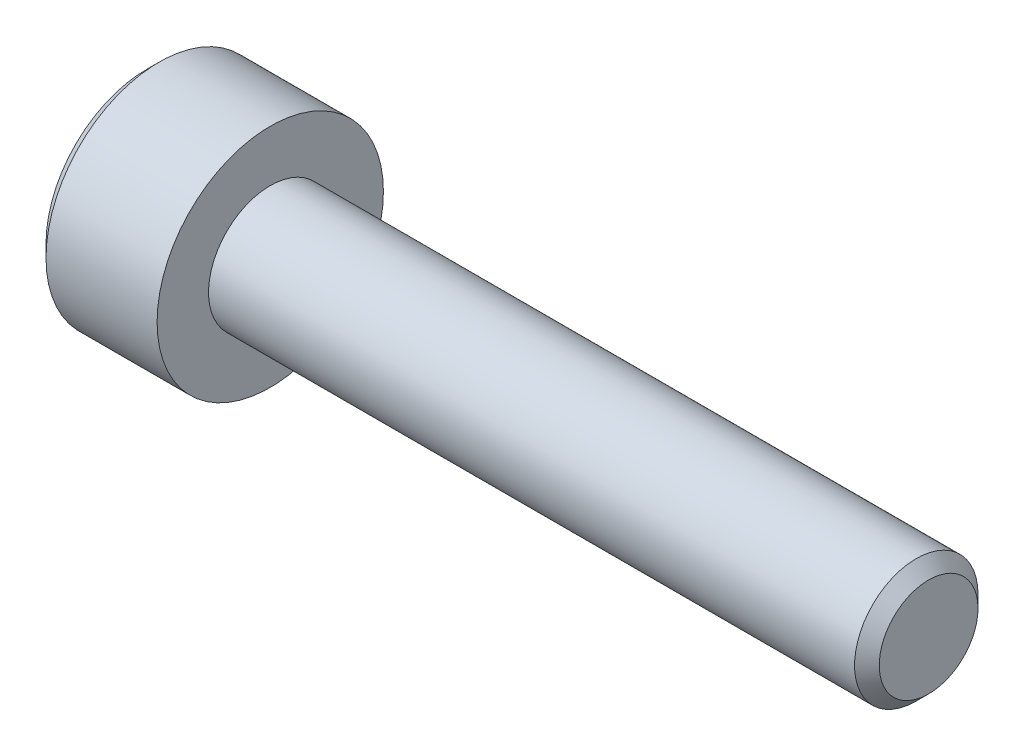
ISO-10303-21;
HEADER;
FILE_DESCRIPTION(('STEP AP214'),'2;1');
FILE_NAME('part.step','',(''),(''),'','','');
FILE_SCHEMA(('AUTOMOTIVE_DESIGN { 1 0 10303 214 1 1 1 1 }'));
ENDSEC;
DATA;
#1=APPLICATION_CONTEXT('core data for automotive mechanical design processes');
#2=APPLICATION_PROTOCOL_DEFINITION('international standard','automotive_design',2000,#1);
#3=PRODUCT_CONTEXT('',#1,'mechanical');
#4=PRODUCT('Part','Part','',(#3));
#5=PRODUCT_RELATED_PRODUCT_CATEGORY('part','',(#4));
#6=PRODUCT_DEFINITION_FORMATION('','',#4);
#7=PRODUCT_DEFINITION_CONTEXT('part definition',#1,'design');
#8=PRODUCT_DEFINITION('design','',#6,#7);
#9=PRODUCT_DEFINITION_SHAPE('','',#8);
#10=(LENGTH_UNIT() NAMED_UNIT(*) SI_UNIT(.MILLI.,.METRE.));
#11=(NAMED_UNIT(*) PLANE_ANGLE_UNIT() SI_UNIT($,.RADIAN.));
#12=(NAMED_UNIT(*) SI_UNIT($,.STERADIAN.) SOLID_ANGLE_UNIT());
#13=UNCERTAINTY_MEASURE_WITH_UNIT(LENGTH_MEASURE(1.E-05),#10,'distance_accuracy_value','');
#14=(GEOMETRIC_REPRESENTATION_CONTEXT(3) GLOBAL_UNCERTAINTY_ASSIGNED_CONTEXT((#13)) GLOBAL_UNIT_ASSIGNED_CONTEXT((#10,
#11,#12)) REPRESENTATION_CONTEXT('',''));
#15=CARTESIAN_POINT('',(0.,0.,0.));
#16=DIRECTION('',(0.,0.,1.));
#17=DIRECTION('',(1.,0.,0.));
#18=AXIS2_PLACEMENT_3D('',#15,#16,#17);
#19=CARTESIAN_POINT('',(1.3,0.,0.));
#20=DIRECTION('',(-1.,0.,0.));
#21=DIRECTION('',(0.,0.,1.));
#22=AXIS2_PLACEMENT_3D('',#19,#20,#21);
#23=PLANE('',#22);
#24=DIRECTION('',(0.,-1.,0.));
#25=VECTOR('',#24,1.);
#26=CARTESIAN_POINT('',(1.3,0.739008344562717,-1.28));
#27=LINE('',#26,#25);
#28=CARTESIAN_POINT('',(1.3,0.739008344562717,-1.28));
#29=VERTEX_POINT('',#28);
#30=CARTESIAN_POINT('',(1.3,0.,-1.28));
#31=VERTEX_POINT('',#30);
#32=EDGE_CURVE('E348',#29,#31,#27,.T.);
#33=ORIENTED_EDGE('',*,*,#32,.T.);
#34=CARTESIAN_POINT('',(1.3,0.,0.));
#35=DIRECTION('',(1.,0.,0.));
#36=DIRECTION('',(0.,0.,-1.));
#37=AXIS2_PLACEMENT_3D('',#34,#35,#36);
#38=CIRCLE('',#37,1.28);
#39=CARTESIAN_POINT('',(1.3,1.10851251684408,-0.640000000000002));
#40=VERTEX_POINT('',#39);
#41=EDGE_CURVE('E52',#31,#40,#38,.T.);
#42=ORIENTED_EDGE('',*,*,#41,.T.);
#43=DIRECTION('',(0.,-0.500000000000002,-0.866025403784437));
#44=VECTOR('',#43,1.);
#45=CARTESIAN_POINT('',(1.3,1.47801668912544,0.));
#46=LINE('',#45,#44);
#47=EDGE_CURVE('E337',#40,#29,#46,.T.);
#48=ORIENTED_EDGE('',*,*,#47,.T.);
#49=EDGE_LOOP('',(#33,#42,#48));
#50=FACE_BOUND('',#49,.T.);
#51=ADVANCED_FACE('F36',(#50),#23,.T.);
#52=CARTESIAN_POINT('',(1.3,1.47801668912544,0.));
#53=VERTEX_POINT('',#52);
#54=EDGE_CURVE('E340',#53,#40,#46,.T.);
#55=ORIENTED_EDGE('',*,*,#54,.T.);
#56=CARTESIAN_POINT('',(1.3,1.10851251684408,0.639999999999997));
#57=VERTEX_POINT('',#56);
#58=EDGE_CURVE('E205',#40,#57,#38,.T.);
#59=ORIENTED_EDGE('',*,*,#58,.T.);
#60=DIRECTION('',(0.,0.499999999999999,-0.866025403784439));
#61=VECTOR('',#60,1.);
#62=CARTESIAN_POINT('',(1.3,0.739008344562719,1.28));
#63=LINE('',#62,#61);
#64=EDGE_CURVE('E338',#57,#53,#63,.T.);
#65=ORIENTED_EDGE('',*,*,#64,.T.);
#66=EDGE_LOOP('',(#55,#59,#65));
#67=FACE_BOUND('',#66,.T.);
#68=ADVANCED_FACE('F125',(#67),#23,.T.);
#69=CARTESIAN_POINT('',(1.3,0.739008344562719,1.28));
#70=VERTEX_POINT('',#69);
#71=EDGE_CURVE('E332',#70,#57,#63,.T.);
#72=ORIENTED_EDGE('',*,*,#71,.T.);
#73=CARTESIAN_POINT('',(1.3,0.,1.28));
#74=VERTEX_POINT('',#73);
#75=EDGE_CURVE('E333',#57,#74,#38,.T.);
#76=ORIENTED_EDGE('',*,*,#75,.T.);
#77=DIRECTION('',(0.,1.,0.));
#78=VECTOR('',#77,1.);
#79=CARTESIAN_POINT('',(1.3,-0.739008344562723,1.28));
#80=LINE('',#79,#78);
#81=EDGE_CURVE('E335',#74,#70,#80,.T.);
#82=ORIENTED_EDGE('',*,*,#81,.T.);
#83=EDGE_LOOP('',(#72,#76,#82));
#84=FACE_BOUND('',#83,.T.);
#85=ADVANCED_FACE('F130',(#84),#23,.T.);
#86=CARTESIAN_POINT('',(1.3,-0.739008344562723,1.28));
#87=VERTEX_POINT('',#86);
#88=EDGE_CURVE('E342',#87,#74,#80,.T.);
#89=ORIENTED_EDGE('',*,*,#88,.T.);
#90=CARTESIAN_POINT('',(1.3,-1.10851251684408,0.640000000000002));
#91=VERTEX_POINT('',#90);
#92=EDGE_CURVE('E392',#74,#91,#38,.T.);
#93=ORIENTED_EDGE('',*,*,#92,.T.);
#94=DIRECTION('',(0.,0.500000000000003,0.866025403784437));
#95=VECTOR('',#94,1.);
#96=CARTESIAN_POINT('',(1.3,-1.47801668912545,0.));
#97=LINE('',#96,#95);
#98=EDGE_CURVE('E354',#91,#87,#97,.T.);
#99=ORIENTED_EDGE('',*,*,#98,.T.);
#100=EDGE_LOOP('',(#89,#93,#99));
#101=FACE_BOUND('',#100,.T.);
#102=ADVANCED_FACE('F183',(#101),#23,.T.);
#103=CARTESIAN_POINT('',(1.3,-1.47801668912545,0.));
#104=VERTEX_POINT('',#103);
#105=EDGE_CURVE('E355',#104,#91,#97,.T.);
#106=ORIENTED_EDGE('',*,*,#105,.T.);
#107=CARTESIAN_POINT('',(1.3,-1.10851251684408,-0.640000000000002));
#108=VERTEX_POINT('',#107);
#109=EDGE_CURVE('E393',#91,#108,#38,.T.);
#110=ORIENTED_EDGE('',*,*,#109,.T.);
#111=DIRECTION('',(0.,-0.500000000000002,0.866025403784437));
#112=VECTOR('',#111,1.);
#113=CARTESIAN_POINT('',(1.3,-0.739008344562725,-1.28));
#114=LINE('',#113,#112);
#115=EDGE_CURVE('E350',#108,#104,#114,.T.);
#116=ORIENTED_EDGE('',*,*,#115,.T.);
#117=EDGE_LOOP('',(#106,#110,#116));
#118=FACE_BOUND('',#117,.T.);
#119=ADVANCED_FACE('F123',(#118),#23,.T.);
#120=CARTESIAN_POINT('',(3.,0.,0.));
#121=DIRECTION('',(-1.,0.,0.));
#122=DIRECTION('',(0.,0.,1.));
#123=AXIS2_PLACEMENT_3D('',#120,#121,#122);
#124=CYLINDRICAL_SURFACE('',#123,2.75);
#125=CARTESIAN_POINT('',(0.299999999999998,0.,0.));
#126=DIRECTION('',(-1.,0.,0.));
#127=DIRECTION('',(0.,0.,1.));
#128=AXIS2_PLACEMENT_3D('',#125,#126,#127);
#129=CIRCLE('',#128,2.75);
#130=CARTESIAN_POINT('',(0.299999999999998,0.,2.75));
#131=VERTEX_POINT('',#130);
#132=EDGE_CURVE('E11',#131,#131,#129,.F.);
#133=ORIENTED_EDGE('',*,*,#132,.T.);
#134=EDGE_LOOP('',(#133));
#135=FACE_BOUND('',#134,.T.);
#136=CARTESIAN_POINT('',(3.,0.,0.));
#137=DIRECTION('',(-1.,0.,0.));
#138=DIRECTION('',(0.,0.,1.));
#139=AXIS2_PLACEMENT_3D('',#136,#137,#138);
#140=CIRCLE('',#139,2.75);
#141=CARTESIAN_POINT('',(3.,0.,2.75));
#142=VERTEX_POINT('',#141);
#143=EDGE_CURVE('E189',#142,#142,#140,.T.);
#144=ORIENTED_EDGE('',*,*,#143,.T.);
#145=EDGE_LOOP('',(#144));
#146=FACE_BOUND('',#145,.T.);
#147=ADVANCED_FACE('F171',(#135,#146),#124,.T.);
#148=CARTESIAN_POINT('',(3.,2.75,0.));
#149=DIRECTION('',(1.,0.,0.));
#150=DIRECTION('',(0.,0.,-1.));
#151=AXIS2_PLACEMENT_3D('',#148,#149,#150);
#152=PLANE('',#151);
#153=CARTESIAN_POINT('',(3.,0.,0.));
#154=DIRECTION('',(1.,0.,0.));
#155=DIRECTION('',(0.,0.,-1.));
#156=AXIS2_PLACEMENT_3D('',#153,#154,#155);
#157=CIRCLE('',#156,1.5);
#158=CARTESIAN_POINT('',(3.,0.,-1.5));
#159=VERTEX_POINT('',#158);
#160=EDGE_CURVE('E191',#159,#159,#157,.T.);
#161=ORIENTED_EDGE('',*,*,#160,.F.);
#162=EDGE_LOOP('',(#161));
#163=FACE_BOUND('',#162,.T.);
#164=ORIENTED_EDGE('',*,*,#143,.F.);
#165=EDGE_LOOP('',(#164));
#166=FACE_BOUND('',#165,.T.);
#167=ADVANCED_FACE('F167',(#163,#166),#152,.T.);
#168=CARTESIAN_POINT('',(0.,0.,0.));
#169=DIRECTION('',(-1.,0.,0.));
#170=DIRECTION('',(0.,0.,1.));
#171=AXIS2_PLACEMENT_3D('',#168,#169,#170);
#172=PLANE('',#171);
#173=CARTESIAN_POINT('',(0.,0.,0.));
#174=DIRECTION('',(-1.,0.,0.));
#175=DIRECTION('',(0.,0.,1.));
#176=AXIS2_PLACEMENT_3D('',#173,#174,#175);
#177=CIRCLE('',#176,2.45);
#178=CARTESIAN_POINT('',(0.,0.,2.45));
#179=VERTEX_POINT('',#178);
#180=EDGE_CURVE('E45',#179,#179,#177,.T.);
#181=ORIENTED_EDGE('',*,*,#180,.T.);
#182=EDGE_LOOP('',(#181));
#183=FACE_BOUND('',#182,.T.);
#184=DIRECTION('',(0.,1.,0.));
#185=VECTOR('',#184,1.);
#186=CARTESIAN_POINT('',(0.,-0.739008344562723,1.28));
#187=LINE('',#186,#185);
#188=CARTESIAN_POINT('',(0.,-0.739008344562723,1.28));
#189=VERTEX_POINT('',#188);
#190=CARTESIAN_POINT('',(0.,0.739008344562719,1.28));
#191=VERTEX_POINT('',#190);
#192=EDGE_CURVE('E60',#189,#191,#187,.T.);
#193=ORIENTED_EDGE('',*,*,#192,.F.);
#194=DIRECTION('',(0.,0.500000000000003,0.866025403784437));
#195=VECTOR('',#194,1.);
#196=CARTESIAN_POINT('',(0.,-1.47801668912545,0.));
#197=LINE('',#196,#195);
#198=CARTESIAN_POINT('',(0.,-1.47801668912545,0.));
#199=VERTEX_POINT('',#198);
#200=EDGE_CURVE('E372',#199,#189,#197,.T.);
#201=ORIENTED_EDGE('',*,*,#200,.F.);
#202=DIRECTION('',(0.,-0.500000000000002,0.866025403784437));
#203=VECTOR('',#202,1.);
#204=CARTESIAN_POINT('',(0.,-0.739008344562725,-1.28));
#205=LINE('',#204,#203);
#206=CARTESIAN_POINT('',(0.,-0.739008344562725,-1.28));
#207=VERTEX_POINT('',#206);
#208=EDGE_CURVE('E369',#207,#199,#205,.T.);
#209=ORIENTED_EDGE('',*,*,#208,.F.);
#210=DIRECTION('',(0.,-1.,0.));
#211=VECTOR('',#210,1.);
#212=CARTESIAN_POINT('',(0.,0.739008344562717,-1.28));
#213=LINE('',#212,#211);
#214=CARTESIAN_POINT('',(0.,0.739008344562717,-1.28));
#215=VERTEX_POINT('',#214);
#216=EDGE_CURVE('E366',#215,#207,#213,.T.);
#217=ORIENTED_EDGE('',*,*,#216,.F.);
#218=DIRECTION('',(0.,-0.500000000000002,-0.866025403784437));
#219=VECTOR('',#218,1.);
#220=CARTESIAN_POINT('',(0.,1.47801668912544,0.));
#221=LINE('',#220,#219);
#222=CARTESIAN_POINT('',(0.,1.47801668912544,0.));
#223=VERTEX_POINT('',#222);
#224=EDGE_CURVE('E363',#223,#215,#221,.T.);
#225=ORIENTED_EDGE('',*,*,#224,.F.);
#226=DIRECTION('',(0.,0.499999999999999,-0.866025403784439));
#227=VECTOR('',#226,1.);
#228=CARTESIAN_POINT('',(0.,0.739008344562719,1.28));
#229=LINE('',#228,#227);
#230=EDGE_CURVE('E360',#191,#223,#229,.T.);
#231=ORIENTED_EDGE('',*,*,#230,.F.);
#232=EDGE_LOOP('',(#193,#201,#209,#217,#225,#231));
#233=FACE_BOUND('',#232,.T.);
#234=ADVANCED_FACE('F163',(#183,#233),#172,.T.);
#235=CARTESIAN_POINT('',(19.,0.,0.));
#236=DIRECTION('',(-1.,0.,0.));
#237=DIRECTION('',(0.,0.,1.));
#238=AXIS2_PLACEMENT_3D('',#235,#236,#237);
#239=CYLINDRICAL_SURFACE('',#238,1.5);
#240=CARTESIAN_POINT('',(18.7,0.,0.));
#241=DIRECTION('',(1.,0.,0.));
#242=DIRECTION('',(0.,0.,-1.));
#243=AXIS2_PLACEMENT_3D('',#240,#241,#242);
#244=CIRCLE('',#243,1.5);
#245=CARTESIAN_POINT('',(18.7,0.,-1.5));
#246=VERTEX_POINT('',#245);
#247=EDGE_CURVE('E204',#246,#246,#244,.F.);
#248=ORIENTED_EDGE('',*,*,#247,.T.);
#249=EDGE_LOOP('',(#248));
#250=FACE_BOUND('',#249,.T.);
#251=ORIENTED_EDGE('',*,*,#160,.T.);
#252=EDGE_LOOP('',(#251));
#253=FACE_BOUND('',#252,.T.);
#254=ADVANCED_FACE('F159',(#250,#253),#239,.T.);
#255=CARTESIAN_POINT('',(19.,0.,0.));
#256=DIRECTION('',(1.,0.,0.));
#257=DIRECTION('',(0.,0.,-1.));
#258=AXIS2_PLACEMENT_3D('',#255,#256,#257);
#259=PLANE('',#258);
#260=CARTESIAN_POINT('',(19.,0.,0.));
#261=DIRECTION('',(1.,0.,0.));
#262=DIRECTION('',(0.,0.,-1.));
#263=AXIS2_PLACEMENT_3D('',#260,#261,#262);
#264=CIRCLE('',#263,1.2);
#265=CARTESIAN_POINT('',(19.,0.,-1.2));
#266=VERTEX_POINT('',#265);
#267=EDGE_CURVE('E201',#266,#266,#264,.T.);
#268=ORIENTED_EDGE('',*,*,#267,.T.);
#269=EDGE_LOOP('',(#268));
#270=FACE_BOUND('',#269,.T.);
#271=ADVANCED_FACE('F156',(#270),#259,.T.);
#272=CARTESIAN_POINT('',(1.3,-0.739008344562723,1.28));
#273=DIRECTION('',(0.,0.,1.));
#274=DIRECTION('',(1.,0.,0.));
#275=AXIS2_PLACEMENT_3D('',#272,#273,#274);
#276=PLANE('',#275);
#277=ORIENTED_EDGE('',*,*,#192,.T.);
#278=DIRECTION('',(-1.,0.,0.));
#279=VECTOR('',#278,1.);
#280=CARTESIAN_POINT('',(1.3,0.739008344562719,1.28));
#281=LINE('',#280,#279);
#282=EDGE_CURVE('E358',#70,#191,#281,.T.);
#283=ORIENTED_EDGE('',*,*,#282,.F.);
#284=ORIENTED_EDGE('',*,*,#81,.F.);
#285=ORIENTED_EDGE('',*,*,#88,.F.);
#286=DIRECTION('',(-1.,0.,0.));
#287=VECTOR('',#286,1.);
#288=CARTESIAN_POINT('',(1.3,-0.739008344562723,1.28));
#289=LINE('',#288,#287);
#290=EDGE_CURVE('E192',#87,#189,#289,.T.);
#291=ORIENTED_EDGE('',*,*,#290,.T.);
#292=EDGE_LOOP('',(#277,#283,#284,#285,#291));
#293=FACE_BOUND('',#292,.T.);
#294=ADVANCED_FACE('F138',(#293),#276,.F.);
#295=CARTESIAN_POINT('',(1.3,-1.47801668912545,0.));
#296=DIRECTION('',(0.,-0.866025403784437,0.500000000000003));
#297=DIRECTION('',(0.,-0.500000000000003,-0.866025403784437));
#298=AXIS2_PLACEMENT_3D('',#295,#296,#297);
#299=PLANE('',#298);
#300=ORIENTED_EDGE('',*,*,#200,.T.);
#301=ORIENTED_EDGE('',*,*,#290,.F.);
#302=ORIENTED_EDGE('',*,*,#98,.F.);
#303=ORIENTED_EDGE('',*,*,#105,.F.);
#304=DIRECTION('',(-1.,0.,0.));
#305=VECTOR('',#304,1.);
#306=CARTESIAN_POINT('',(1.3,-1.47801668912545,0.));
#307=LINE('',#306,#305);
#308=EDGE_CURVE('E197',#104,#199,#307,.T.);
#309=ORIENTED_EDGE('',*,*,#308,.T.);
#310=EDGE_LOOP('',(#300,#301,#302,#303,#309));
#311=FACE_BOUND('',#310,.T.);
#312=ADVANCED_FACE('F134',(#311),#299,.F.);
#313=CARTESIAN_POINT('',(1.3,-0.739008344562725,-1.28));
#314=DIRECTION('',(0.,-0.866025403784437,-0.500000000000002));
#315=DIRECTION('',(0.,0.500000000000002,-0.866025403784437));
#316=AXIS2_PLACEMENT_3D('',#313,#314,#315);
#317=PLANE('',#316);
#318=ORIENTED_EDGE('',*,*,#208,.T.);
#319=ORIENTED_EDGE('',*,*,#308,.F.);
#320=ORIENTED_EDGE('',*,*,#115,.F.);
#321=CARTESIAN_POINT('',(1.3,-0.739008344562725,-1.28));
#322=VERTEX_POINT('',#321);
#323=EDGE_CURVE('E351',#322,#108,#114,.T.);
#324=ORIENTED_EDGE('',*,*,#323,.F.);
#325=DIRECTION('',(-1.,0.,0.));
#326=VECTOR('',#325,1.);
#327=CARTESIAN_POINT('',(1.3,-0.739008344562725,-1.28));
#328=LINE('',#327,#326);
#329=EDGE_CURVE('E376',#322,#207,#328,.T.);
#330=ORIENTED_EDGE('',*,*,#329,.T.);
#331=EDGE_LOOP('',(#318,#319,#320,#324,#330));
#332=FACE_BOUND('',#331,.T.);
#333=ADVANCED_FACE('F137',(#332),#317,.F.);
#334=CARTESIAN_POINT('',(1.3,0.739008344562717,-1.28));
#335=DIRECTION('',(0.,0.,-1.));
#336=DIRECTION('',(-1.,0.,0.));
#337=AXIS2_PLACEMENT_3D('',#334,#335,#336);
#338=PLANE('',#337);
#339=ORIENTED_EDGE('',*,*,#216,.T.);
#340=ORIENTED_EDGE('',*,*,#329,.F.);
#341=EDGE_CURVE('E347',#31,#322,#27,.T.);
#342=ORIENTED_EDGE('',*,*,#341,.F.);
#343=ORIENTED_EDGE('',*,*,#32,.F.);
#344=DIRECTION('',(-1.,0.,0.));
#345=VECTOR('',#344,1.);
#346=CARTESIAN_POINT('',(1.3,0.739008344562717,-1.28));
#347=LINE('',#346,#345);
#348=EDGE_CURVE('E378',#29,#215,#347,.T.);
#349=ORIENTED_EDGE('',*,*,#348,.T.);
#350=EDGE_LOOP('',(#339,#340,#342,#343,#349));
#351=FACE_BOUND('',#350,.T.);
#352=ADVANCED_FACE('F142',(#351),#338,.F.);
#353=CARTESIAN_POINT('',(1.3,1.47801668912544,0.));
#354=DIRECTION('',(0.,0.866025403784437,-0.500000000000002));
#355=DIRECTION('',(0.,0.500000000000002,0.866025403784437));
#356=AXIS2_PLACEMENT_3D('',#353,#354,#355);
#357=PLANE('',#356);
#358=ORIENTED_EDGE('',*,*,#224,.T.);
#359=ORIENTED_EDGE('',*,*,#348,.F.);
#360=ORIENTED_EDGE('',*,*,#47,.F.);
#361=ORIENTED_EDGE('',*,*,#54,.F.);
#362=DIRECTION('',(-1.,0.,0.));
#363=VECTOR('',#362,1.);
#364=CARTESIAN_POINT('',(1.3,1.47801668912544,0.));
#365=LINE('',#364,#363);
#366=EDGE_CURVE('E380',#53,#223,#365,.T.);
#367=ORIENTED_EDGE('',*,*,#366,.T.);
#368=EDGE_LOOP('',(#358,#359,#360,#361,#367));
#369=FACE_BOUND('',#368,.T.);
#370=ADVANCED_FACE('F146',(#369),#357,.F.);
#371=CARTESIAN_POINT('',(1.3,0.739008344562719,1.28));
#372=DIRECTION('',(0.,0.866025403784439,0.499999999999999));
#373=DIRECTION('',(0.,-0.499999999999999,0.866025403784439));
#374=AXIS2_PLACEMENT_3D('',#371,#372,#373);
#375=PLANE('',#374);
#376=ORIENTED_EDGE('',*,*,#230,.T.);
#377=ORIENTED_EDGE('',*,*,#366,.F.);
#378=ORIENTED_EDGE('',*,*,#64,.F.);
#379=ORIENTED_EDGE('',*,*,#71,.F.);
#380=ORIENTED_EDGE('',*,*,#282,.T.);
#381=EDGE_LOOP('',(#376,#377,#378,#379,#380));
#382=FACE_BOUND('',#381,.T.);
#383=ADVANCED_FACE('F120',(#382),#375,.F.);
#384=ORIENTED_EDGE('',*,*,#323,.T.);
#385=EDGE_CURVE('E195',#108,#31,#38,.T.);
#386=ORIENTED_EDGE('',*,*,#385,.T.);
#387=ORIENTED_EDGE('',*,*,#341,.T.);
#388=EDGE_LOOP('',(#384,#386,#387));
#389=FACE_BOUND('',#388,.T.);
#390=ADVANCED_FACE('F113',(#389),#23,.T.);
#391=CARTESIAN_POINT('',(2.03900834456272,0.,0.));
#392=DIRECTION('',(-1.,0.,0.));
#393=DIRECTION('',(0.,0.,1.));
#394=AXIS2_PLACEMENT_3D('',#391,#392,#393);
#395=CONICAL_SURFACE('',#394,0.,1.0471975511966);
#396=ORIENTED_EDGE('',*,*,#41,.F.);
#397=ORIENTED_EDGE('',*,*,#385,.F.);
#398=ORIENTED_EDGE('',*,*,#109,.F.);
#399=ORIENTED_EDGE('',*,*,#92,.F.);
#400=ORIENTED_EDGE('',*,*,#75,.F.);
#401=ORIENTED_EDGE('',*,*,#58,.F.);
#402=EDGE_LOOP('',(#396,#397,#398,#399,#400,#401));
#403=FACE_BOUND('',#402,.T.);
#404=CARTESIAN_POINT('',(2.03900834456272,0.,0.));
#405=VERTEX_POINT('',#404);
#406=VERTEX_LOOP('',#405);
#407=FACE_BOUND('',#406,.T.);
#408=ADVANCED_FACE('F110',(#403,#407),#395,.F.);
#409=CARTESIAN_POINT('',(19.,0.,0.));
#410=DIRECTION('',(-1.,0.,0.));
#411=DIRECTION('',(0.,0.,1.));
#412=AXIS2_PLACEMENT_3D('',#409,#410,#411);
#413=CONICAL_SURFACE('',#412,1.2,0.785398163397452);
#414=ORIENTED_EDGE('',*,*,#247,.F.);
#415=EDGE_LOOP('',(#414));
#416=FACE_BOUND('',#415,.T.);
#417=ORIENTED_EDGE('',*,*,#267,.F.);
#418=EDGE_LOOP('',(#417));
#419=FACE_BOUND('',#418,.T.);
#420=ADVANCED_FACE('F112',(#416,#419),#413,.T.);
#421=CARTESIAN_POINT('',(0.,0.,0.));
#422=DIRECTION('',(1.,0.,0.));
#423=DIRECTION('',(0.,0.,-1.));
#424=AXIS2_PLACEMENT_3D('',#421,#422,#423);
#425=CONICAL_SURFACE('',#424,2.45,0.78539816339745);
#426=ORIENTED_EDGE('',*,*,#132,.F.);
#427=EDGE_LOOP('',(#426));
#428=FACE_BOUND('',#427,.T.);
#429=ORIENTED_EDGE('',*,*,#180,.F.);
#430=EDGE_LOOP('',(#429));
#431=FACE_BOUND('',#430,.T.);
#432=ADVANCED_FACE('F39',(#428,#431),#425,.T.);
#433=CLOSED_SHELL('',(#51,#68,#85,#102,#119,#147,#167,#234,#254,#271,#294,#312,#333,#352,#370,
#383,#390,#408,#420,#432));
#434=MANIFOLD_SOLID_BREP('B2',#433);
#435=ADVANCED_BREP_SHAPE_REPRESENTATION('',(#18,#434),#14);
#436=SHAPE_DEFINITION_REPRESENTATION(#9,#435);
ENDSEC;
END-ISO-10303-21;
